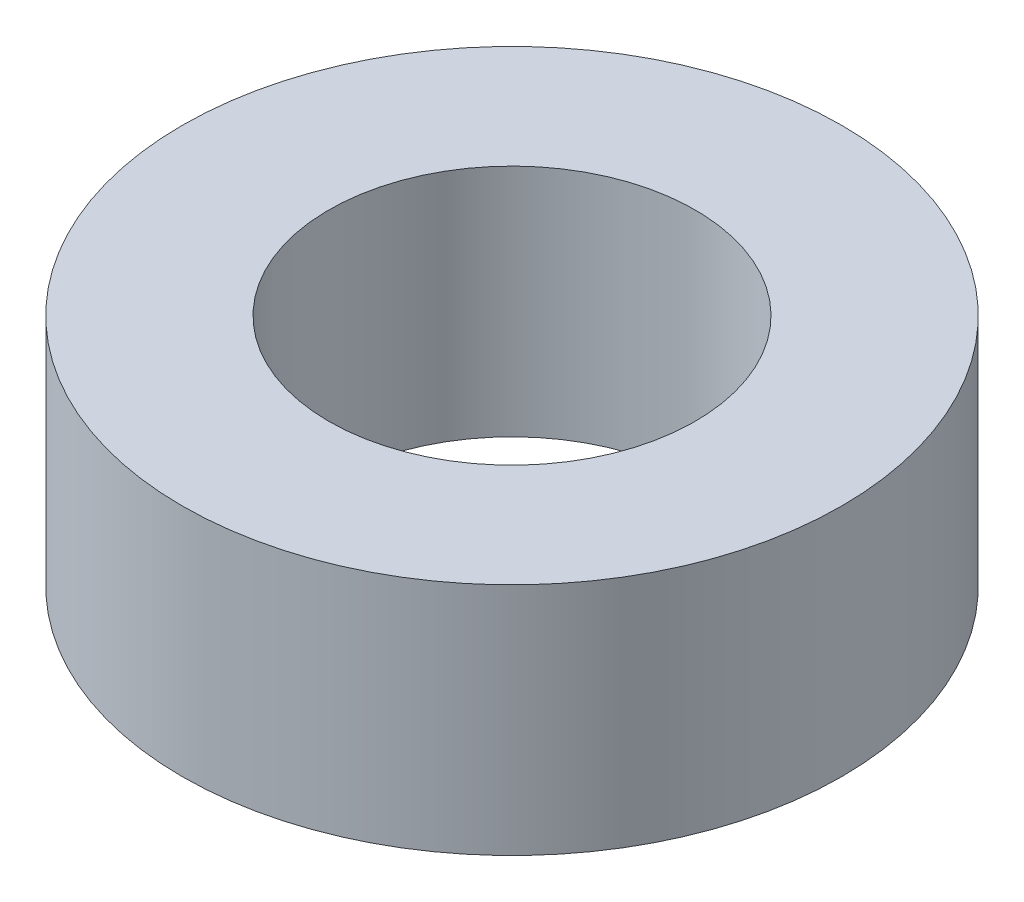
ISO-10303-21;
HEADER;
FILE_DESCRIPTION(('STEP AP214'),'2;1');
FILE_NAME('part.step','',(''),(''),'','','');
FILE_SCHEMA(('AUTOMOTIVE_DESIGN { 1 0 10303 214 1 1 1 1 }'));
ENDSEC;
DATA;
#1=APPLICATION_CONTEXT('core data for automotive mechanical design processes');
#2=APPLICATION_PROTOCOL_DEFINITION('international standard','automotive_design',2000,#1);
#3=PRODUCT_CONTEXT('',#1,'mechanical');
#4=PRODUCT('Part','Part','',(#3));
#5=PRODUCT_RELATED_PRODUCT_CATEGORY('part','',(#4));
#6=PRODUCT_DEFINITION_FORMATION('','',#4);
#7=PRODUCT_DEFINITION_CONTEXT('part definition',#1,'design');
#8=PRODUCT_DEFINITION('design','',#6,#7);
#9=PRODUCT_DEFINITION_SHAPE('','',#8);
#10=(LENGTH_UNIT() NAMED_UNIT(*) SI_UNIT(.MILLI.,.METRE.));
#11=(NAMED_UNIT(*) PLANE_ANGLE_UNIT() SI_UNIT($,.RADIAN.));
#12=(NAMED_UNIT(*) SI_UNIT($,.STERADIAN.) SOLID_ANGLE_UNIT());
#13=UNCERTAINTY_MEASURE_WITH_UNIT(LENGTH_MEASURE(1.E-05),#10,'distance_accuracy_value','');
#14=(GEOMETRIC_REPRESENTATION_CONTEXT(3) GLOBAL_UNCERTAINTY_ASSIGNED_CONTEXT((#13)) GLOBAL_UNIT_ASSIGNED_CONTEXT((#10,
#11,#12)) REPRESENTATION_CONTEXT('',''));
#15=CARTESIAN_POINT('',(0.,0.,0.));
#16=DIRECTION('',(0.,0.,1.));
#17=DIRECTION('',(1.,0.,0.));
#18=AXIS2_PLACEMENT_3D('',#15,#16,#17);
#19=CARTESIAN_POINT('',(0.,16.,0.));
#20=DIRECTION('',(0.,-1.,0.));
#21=DIRECTION('',(0.,0.,-1.));
#22=AXIS2_PLACEMENT_3D('',#19,#20,#21);
#23=CYLINDRICAL_SURFACE('',#22,22.5);
#24=CARTESIAN_POINT('',(0.,16.,0.));
#25=DIRECTION('',(0.,1.,0.));
#26=DIRECTION('',(0.,0.,1.));
#27=AXIS2_PLACEMENT_3D('',#24,#25,#26);
#28=CIRCLE('',#27,22.5);
#29=CARTESIAN_POINT('',(0.,16.,22.5));
#30=VERTEX_POINT('',#29);
#31=EDGE_CURVE('E10',#30,#30,#28,.T.);
#32=ORIENTED_EDGE('',*,*,#31,.F.);
#33=EDGE_LOOP('',(#32));
#34=FACE_BOUND('',#33,.T.);
#35=CARTESIAN_POINT('',(0.,0.,0.));
#36=DIRECTION('',(0.,1.,0.));
#37=DIRECTION('',(0.,0.,1.));
#38=AXIS2_PLACEMENT_3D('',#35,#36,#37);
#39=CIRCLE('',#38,22.5);
#40=CARTESIAN_POINT('',(0.,0.,22.5));
#41=VERTEX_POINT('',#40);
#42=EDGE_CURVE('E37',#41,#41,#39,.T.);
#43=ORIENTED_EDGE('',*,*,#42,.T.);
#44=EDGE_LOOP('',(#43));
#45=FACE_BOUND('',#44,.T.);
#46=ADVANCED_FACE('F40',(#34,#45),#23,.T.);
#47=CARTESIAN_POINT('',(0.,16.,0.));
#48=DIRECTION('',(0.,1.,0.));
#49=DIRECTION('',(0.,0.,1.));
#50=AXIS2_PLACEMENT_3D('',#47,#48,#49);
#51=PLANE('',#50);
#52=CARTESIAN_POINT('',(0.,16.,0.));
#53=DIRECTION('',(0.,1.,0.));
#54=DIRECTION('',(0.,0.,1.));
#55=AXIS2_PLACEMENT_3D('',#52,#53,#54);
#56=CIRCLE('',#55,12.5);
#57=CARTESIAN_POINT('',(0.,16.,12.5));
#58=VERTEX_POINT('',#57);
#59=EDGE_CURVE('E50',#58,#58,#56,.T.);
#60=ORIENTED_EDGE('',*,*,#59,.F.);
#61=EDGE_LOOP('',(#60));
#62=FACE_BOUND('',#61,.T.);
#63=ORIENTED_EDGE('',*,*,#31,.T.);
#64=EDGE_LOOP('',(#63));
#65=FACE_BOUND('',#64,.T.);
#66=ADVANCED_FACE('F59',(#62,#65),#51,.T.);
#67=CARTESIAN_POINT('',(0.,0.,0.));
#68=DIRECTION('',(0.,1.,0.));
#69=DIRECTION('',(0.,0.,1.));
#70=AXIS2_PLACEMENT_3D('',#67,#68,#69);
#71=PLANE('',#70);
#72=CARTESIAN_POINT('',(0.,0.,0.));
#73=DIRECTION('',(0.,1.,0.));
#74=DIRECTION('',(0.,0.,1.));
#75=AXIS2_PLACEMENT_3D('',#72,#73,#74);
#76=CIRCLE('',#75,12.5);
#77=CARTESIAN_POINT('',(0.,0.,12.5));
#78=VERTEX_POINT('',#77);
#79=EDGE_CURVE('E47',#78,#78,#76,.T.);
#80=ORIENTED_EDGE('',*,*,#79,.T.);
#81=EDGE_LOOP('',(#80));
#82=FACE_BOUND('',#81,.T.);
#83=ORIENTED_EDGE('',*,*,#42,.F.);
#84=EDGE_LOOP('',(#83));
#85=FACE_BOUND('',#84,.T.);
#86=ADVANCED_FACE('F58',(#82,#85),#71,.F.);
#87=CARTESIAN_POINT('',(0.,16.,0.));
#88=DIRECTION('',(0.,-1.,0.));
#89=DIRECTION('',(0.,0.,-1.));
#90=AXIS2_PLACEMENT_3D('',#87,#88,#89);
#91=CYLINDRICAL_SURFACE('',#90,12.5);
#92=ORIENTED_EDGE('',*,*,#59,.T.);
#93=EDGE_LOOP('',(#92));
#94=FACE_BOUND('',#93,.T.);
#95=ORIENTED_EDGE('',*,*,#79,.F.);
#96=EDGE_LOOP('',(#95));
#97=FACE_BOUND('',#96,.T.);
#98=ADVANCED_FACE('F54',(#94,#97),#91,.F.);
#99=CLOSED_SHELL('',(#46,#66,#86,#98));
#100=MANIFOLD_SOLID_BREP('B2',#99);
#101=ADVANCED_BREP_SHAPE_REPRESENTATION('',(#18,#100),#14);
#102=SHAPE_DEFINITION_REPRESENTATION(#9,#101);
ENDSEC;
END-ISO-10303-21;
